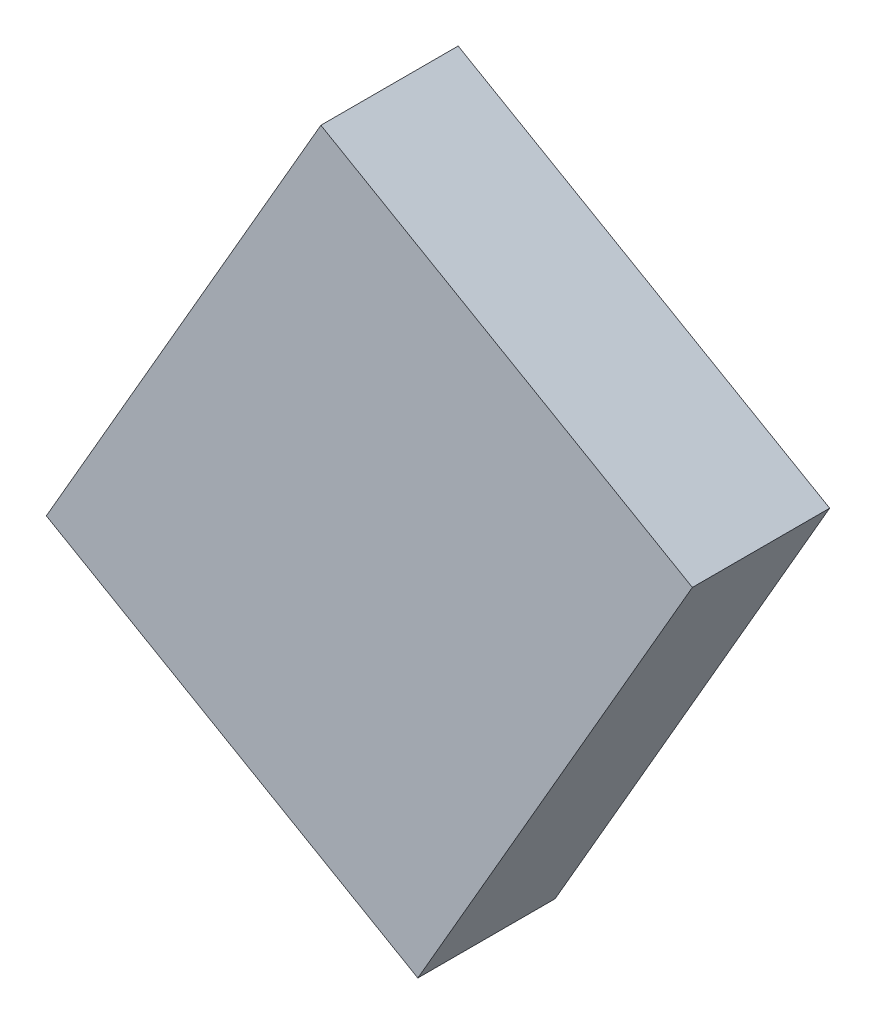
ISO-10303-21;
HEADER;
FILE_DESCRIPTION(('STEP AP214'),'2;1');
FILE_NAME('part.step','',(''),(''),'','','');
FILE_SCHEMA(('AUTOMOTIVE_DESIGN { 1 0 10303 214 1 1 1 1 }'));
ENDSEC;
DATA;
#1=APPLICATION_CONTEXT('core data for automotive mechanical design processes');
#2=APPLICATION_PROTOCOL_DEFINITION('international standard','automotive_design',2000,#1);
#3=PRODUCT_CONTEXT('',#1,'mechanical');
#4=PRODUCT('Part','Part','',(#3));
#5=PRODUCT_RELATED_PRODUCT_CATEGORY('part','',(#4));
#6=PRODUCT_DEFINITION_FORMATION('','',#4);
#7=PRODUCT_DEFINITION_CONTEXT('part definition',#1,'design');
#8=PRODUCT_DEFINITION('design','',#6,#7);
#9=PRODUCT_DEFINITION_SHAPE('','',#8);
#10=(LENGTH_UNIT() NAMED_UNIT(*) SI_UNIT(.MILLI.,.METRE.));
#11=(NAMED_UNIT(*) PLANE_ANGLE_UNIT() SI_UNIT($,.RADIAN.));
#12=(NAMED_UNIT(*) SI_UNIT($,.STERADIAN.) SOLID_ANGLE_UNIT());
#13=UNCERTAINTY_MEASURE_WITH_UNIT(LENGTH_MEASURE(1.E-05),#10,'distance_accuracy_value','');
#14=(GEOMETRIC_REPRESENTATION_CONTEXT(3) GLOBAL_UNCERTAINTY_ASSIGNED_CONTEXT((#13)) GLOBAL_UNIT_ASSIGNED_CONTEXT((#10,
#11,#12)) REPRESENTATION_CONTEXT('',''));
#15=CARTESIAN_POINT('',(0.,0.,0.));
#16=DIRECTION('',(0.,0.,1.));
#17=DIRECTION('',(1.,0.,0.));
#18=AXIS2_PLACEMENT_3D('',#15,#16,#17);
#19=CARTESIAN_POINT('',(0.28253436,-2.0106386,0.80000094));
#20=DIRECTION('',(0.,0.,-1.));
#21=DIRECTION('',(-1.,0.,0.));
#22=AXIS2_PLACEMENT_3D('',#19,#20,#21);
#23=PLANE('',#22);
#24=DIRECTION('',(0.86602559790979,-0.499999663764879,0.));
#25=VECTOR('',#24,1.);
#26=CARTESIAN_POINT('',(1.8825337,0.7606411,0.80000094));
#27=LINE('',#26,#25);
#28=CARTESIAN_POINT('',(1.88253369999973,0.760641100000156,0.80000094));
#29=VERTEX_POINT('',#28);
#30=CARTESIAN_POINT('',(-0.282531819999916,2.01064114000015,0.80000094));
#31=VERTEX_POINT('',#30);
#32=EDGE_CURVE('E54',#29,#31,#27,.F.);
#33=ORIENTED_EDGE('',*,*,#32,.T.);
#34=DIRECTION('',(0.500000060750926,0.866025368709872,0.));
#35=VECTOR('',#34,1.);
#36=CARTESIAN_POINT('',(-0.28253182,2.01064114,0.80000094));
#37=LINE('',#36,#35);
#38=CARTESIAN_POINT('',(-1.88253115999973,-0.760638560000156,0.80000094));
#39=VERTEX_POINT('',#38);
#40=EDGE_CURVE('E56',#31,#39,#37,.F.);
#41=ORIENTED_EDGE('',*,*,#40,.T.);
#42=DIRECTION('',(-0.86602559790979,0.499999663764879,0.));
#43=VECTOR('',#42,1.);
#44=CARTESIAN_POINT('',(-1.88253116,-0.76063856,0.80000094));
#45=LINE('',#44,#43);
#46=CARTESIAN_POINT('',(0.282534359999832,-2.01063860000029,0.80000094));
#47=VERTEX_POINT('',#46);
#48=EDGE_CURVE('E19',#39,#47,#45,.F.);
#49=ORIENTED_EDGE('',*,*,#48,.T.);
#50=DIRECTION('',(-0.500000060750926,-0.866025368709872,0.));
#51=VECTOR('',#50,1.);
#52=CARTESIAN_POINT('',(0.28253436,-2.0106386,0.80000094));
#53=LINE('',#52,#51);
#54=EDGE_CURVE('E79',#47,#29,#53,.F.);
#55=ORIENTED_EDGE('',*,*,#54,.T.);
#56=EDGE_LOOP('',(#33,#41,#49,#55));
#57=FACE_BOUND('',#56,.T.);
#58=ADVANCED_FACE('F16',(#57),#23,.F.);
#59=CARTESIAN_POINT('',(-1.88253116,-0.76063856,0.));
#60=DIRECTION('',(0.499999663764879,0.86602559790979,0.));
#61=DIRECTION('',(-0.86602559790979,0.499999663764879,0.));
#62=AXIS2_PLACEMENT_3D('',#59,#60,#61);
#63=PLANE('',#62);
#64=DIRECTION('',(0.,0.,1.));
#65=VECTOR('',#64,1.);
#66=CARTESIAN_POINT('',(0.28253436,-2.0106386,0.));
#67=LINE('',#66,#65);
#68=CARTESIAN_POINT('',(0.282534359999833,-2.01063860000029,0.));
#69=VERTEX_POINT('',#68);
#70=EDGE_CURVE('E67',#69,#47,#67,.T.);
#71=ORIENTED_EDGE('',*,*,#70,.T.);
#72=ORIENTED_EDGE('',*,*,#48,.F.);
#73=DIRECTION('',(0.,0.,1.));
#74=VECTOR('',#73,1.);
#75=CARTESIAN_POINT('',(-1.88253115999892,-0.760638560000622,0.));
#76=LINE('',#75,#74);
#77=CARTESIAN_POINT('',(-1.88253115999973,-0.760638560000156,0.));
#78=VERTEX_POINT('',#77);
#79=EDGE_CURVE('E62',#39,#78,#76,.F.);
#80=ORIENTED_EDGE('',*,*,#79,.T.);
#81=DIRECTION('',(-0.866025597909924,0.499999663764646,0.));
#82=VECTOR('',#81,1.);
#83=CARTESIAN_POINT('',(0.28253436,-2.0106386,0.));
#84=LINE('',#83,#82);
#85=EDGE_CURVE('E82',#69,#78,#84,.T.);
#86=ORIENTED_EDGE('',*,*,#85,.F.);
#87=EDGE_LOOP('',(#71,#72,#80,#86));
#88=FACE_BOUND('',#87,.T.);
#89=ADVANCED_FACE('F64',(#88),#63,.F.);
#90=CARTESIAN_POINT('',(-0.28253182,2.01064114,0.));
#91=DIRECTION('',(0.866025368709872,-0.500000060750926,0.));
#92=DIRECTION('',(0.500000060750926,0.866025368709872,0.));
#93=AXIS2_PLACEMENT_3D('',#90,#91,#92);
#94=PLANE('',#93);
#95=ORIENTED_EDGE('',*,*,#79,.F.);
#96=ORIENTED_EDGE('',*,*,#40,.F.);
#97=DIRECTION('',(0.,0.,1.));
#98=VECTOR('',#97,1.);
#99=CARTESIAN_POINT('',(-0.282531819999665,2.01064114000058,0.));
#100=LINE('',#99,#98);
#101=CARTESIAN_POINT('',(-0.282531819999916,2.01064114000015,0.));
#102=VERTEX_POINT('',#101);
#103=EDGE_CURVE('E74',#31,#102,#100,.F.);
#104=ORIENTED_EDGE('',*,*,#103,.T.);
#105=DIRECTION('',(0.500000060751263,0.866025368709678,0.));
#106=VECTOR('',#105,1.);
#107=CARTESIAN_POINT('',(-1.88253116,-0.76063856,0.));
#108=LINE('',#107,#106);
#109=EDGE_CURVE('E71',#78,#102,#108,.T.);
#110=ORIENTED_EDGE('',*,*,#109,.F.);
#111=EDGE_LOOP('',(#95,#96,#104,#110));
#112=FACE_BOUND('',#111,.T.);
#113=ADVANCED_FACE('F69',(#112),#94,.F.);
#114=CARTESIAN_POINT('',(1.8825337,0.7606411,0.));
#115=DIRECTION('',(-0.499999663764879,-0.86602559790979,0.));
#116=DIRECTION('',(0.86602559790979,-0.499999663764879,0.));
#117=AXIS2_PLACEMENT_3D('',#114,#115,#116);
#118=PLANE('',#117);
#119=ORIENTED_EDGE('',*,*,#103,.F.);
#120=ORIENTED_EDGE('',*,*,#32,.F.);
#121=DIRECTION('',(0.,0.,1.));
#122=VECTOR('',#121,1.);
#123=CARTESIAN_POINT('',(1.88253369999892,0.760641100000622,0.));
#124=LINE('',#123,#122);
#125=CARTESIAN_POINT('',(1.88253369999973,0.760641100000156,0.));
#126=VERTEX_POINT('',#125);
#127=EDGE_CURVE('E34',#29,#126,#124,.F.);
#128=ORIENTED_EDGE('',*,*,#127,.T.);
#129=DIRECTION('',(0.866025597909924,-0.499999663764646,0.));
#130=VECTOR('',#129,1.);
#131=CARTESIAN_POINT('',(-0.28253182,2.01064114,0.));
#132=LINE('',#131,#130);
#133=EDGE_CURVE('E25',#102,#126,#132,.T.);
#134=ORIENTED_EDGE('',*,*,#133,.F.);
#135=EDGE_LOOP('',(#119,#120,#128,#134));
#136=FACE_BOUND('',#135,.T.);
#137=ADVANCED_FACE('F88',(#136),#118,.F.);
#138=CARTESIAN_POINT('',(0.28253436,-2.0106386,0.));
#139=DIRECTION('',(-0.866025368709872,0.500000060750926,0.));
#140=DIRECTION('',(-0.500000060750926,-0.866025368709872,0.));
#141=AXIS2_PLACEMENT_3D('',#138,#139,#140);
#142=PLANE('',#141);
#143=ORIENTED_EDGE('',*,*,#127,.F.);
#144=ORIENTED_EDGE('',*,*,#54,.F.);
#145=ORIENTED_EDGE('',*,*,#70,.F.);
#146=DIRECTION('',(-0.500000060751263,-0.866025368709678,0.));
#147=VECTOR('',#146,1.);
#148=CARTESIAN_POINT('',(1.8825337,0.7606411,0.));
#149=LINE('',#148,#147);
#150=EDGE_CURVE('E11',#126,#69,#149,.T.);
#151=ORIENTED_EDGE('',*,*,#150,.F.);
#152=EDGE_LOOP('',(#143,#144,#145,#151));
#153=FACE_BOUND('',#152,.T.);
#154=ADVANCED_FACE('F90',(#153),#142,.F.);
#155=CARTESIAN_POINT('',(0.28253436,-2.0106386,0.));
#156=DIRECTION('',(0.,0.,-1.));
#157=DIRECTION('',(-1.,0.,0.));
#158=AXIS2_PLACEMENT_3D('',#155,#156,#157);
#159=PLANE('',#158);
#160=ORIENTED_EDGE('',*,*,#133,.T.);
#161=ORIENTED_EDGE('',*,*,#150,.T.);
#162=ORIENTED_EDGE('',*,*,#85,.T.);
#163=ORIENTED_EDGE('',*,*,#109,.T.);
#164=EDGE_LOOP('',(#160,#161,#162,#163));
#165=FACE_BOUND('',#164,.T.);
#166=ADVANCED_FACE('F87',(#165),#159,.T.);
#167=CLOSED_SHELL('',(#58,#89,#113,#137,#154,#166));
#168=MANIFOLD_SOLID_BREP('B1',#167);
#169=ADVANCED_BREP_SHAPE_REPRESENTATION('',(#18,#168),#14);
#170=SHAPE_DEFINITION_REPRESENTATION(#9,#169);
ENDSEC;
END-ISO-10303-21;
